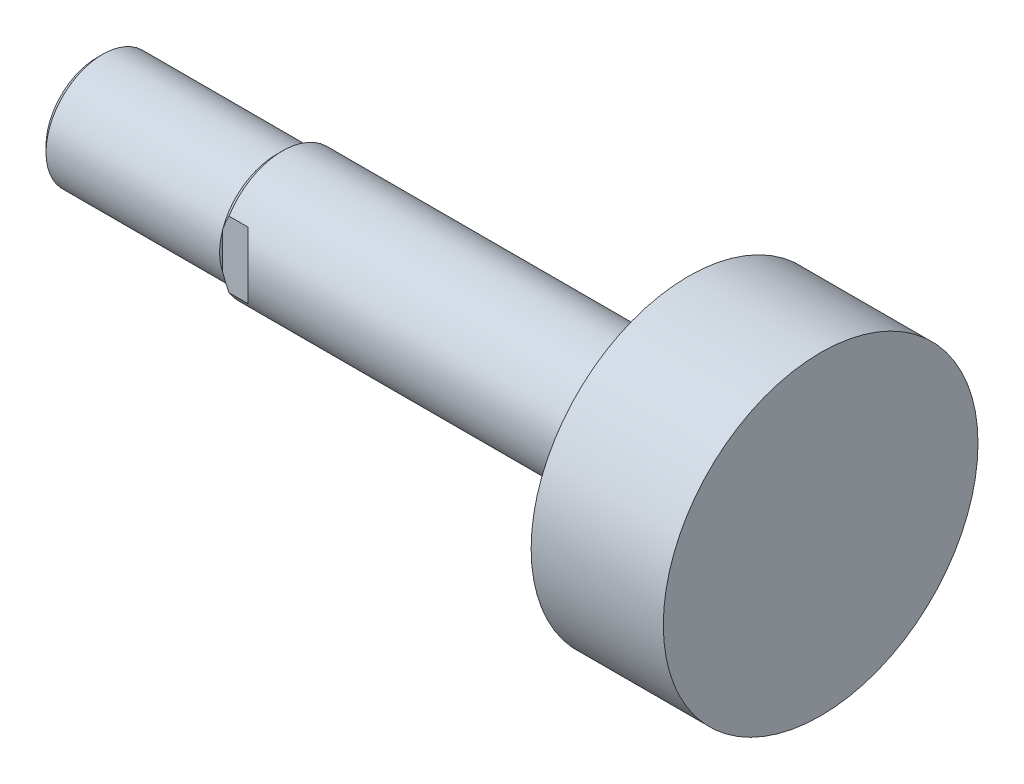
ISO-10303-21;
HEADER;
FILE_DESCRIPTION(('STEP AP214'),'2;1');
FILE_NAME('part.step','',(''),(''),'','','');
FILE_SCHEMA(('AUTOMOTIVE_DESIGN { 1 0 10303 214 1 1 1 1 }'));
ENDSEC;
DATA;
#1=APPLICATION_CONTEXT('core data for automotive mechanical design processes');
#2=APPLICATION_PROTOCOL_DEFINITION('international standard','automotive_design',2000,#1);
#3=PRODUCT_CONTEXT('',#1,'mechanical');
#4=PRODUCT('Part','Part','',(#3));
#5=PRODUCT_RELATED_PRODUCT_CATEGORY('part','',(#4));
#6=PRODUCT_DEFINITION_FORMATION('','',#4);
#7=PRODUCT_DEFINITION_CONTEXT('part definition',#1,'design');
#8=PRODUCT_DEFINITION('design','',#6,#7);
#9=PRODUCT_DEFINITION_SHAPE('','',#8);
#10=(LENGTH_UNIT() NAMED_UNIT(*) SI_UNIT(.MILLI.,.METRE.));
#11=(NAMED_UNIT(*) PLANE_ANGLE_UNIT() SI_UNIT($,.RADIAN.));
#12=(NAMED_UNIT(*) SI_UNIT($,.STERADIAN.) SOLID_ANGLE_UNIT());
#13=UNCERTAINTY_MEASURE_WITH_UNIT(LENGTH_MEASURE(1.E-05),#10,'distance_accuracy_value','');
#14=(GEOMETRIC_REPRESENTATION_CONTEXT(3) GLOBAL_UNCERTAINTY_ASSIGNED_CONTEXT((#13)) GLOBAL_UNIT_ASSIGNED_CONTEXT((#10,
#11,#12)) REPRESENTATION_CONTEXT('',''));
#15=CARTESIAN_POINT('',(0.,0.,0.));
#16=DIRECTION('',(0.,0.,1.));
#17=DIRECTION('',(1.,0.,0.));
#18=AXIS2_PLACEMENT_3D('',#15,#16,#17);
#19=CARTESIAN_POINT('',(-4.,0.,0.));
#20=DIRECTION('',(1.,0.,0.));
#21=DIRECTION('',(0.,0.,-1.));
#22=AXIS2_PLACEMENT_3D('',#19,#20,#21);
#23=CONICAL_SURFACE('',#22,10.,0.785398163397448);
#24=CARTESIAN_POINT('',(-4.,0.,0.));
#25=DIRECTION('',(-1.,0.,0.));
#26=DIRECTION('',(0.,0.,1.));
#27=AXIS2_PLACEMENT_3D('',#24,#25,#26);
#28=CIRCLE('',#27,10.);
#29=CARTESIAN_POINT('',(-4.,5.26782687642637,8.5));
#30=VERTEX_POINT('',#29);
#31=CARTESIAN_POINT('',(-4.,5.26782687642637,-8.5));
#32=VERTEX_POINT('',#31);
#33=EDGE_CURVE('E102',#30,#32,#28,.T.);
#34=ORIENTED_EDGE('',*,*,#33,.T.);
#35=CARTESIAN_POINT('',(8.01519063670047,20.308092445384,-8.5));
#36=CARTESIAN_POINT('',(7.7361785847848,20.0056182532984,-8.5));
#37=CARTESIAN_POINT('',(7.45765995569865,19.7026880348964,-8.5));
#38=CARTESIAN_POINT('',(6.90176517488605,19.0957771073713,-8.5));
#39=CARTESIAN_POINT('',(6.62438903182765,18.7917963903104,-8.5));
#40=CARTESIAN_POINT('',(6.07087745418935,18.1825827710552,-8.5));
#41=CARTESIAN_POINT('',(5.79474230969481,17.8773496050566,-8.5));
#42=CARTESIAN_POINT('',(5.24398019039066,17.2655281148894,-8.5));
#43=CARTESIAN_POINT('',(4.96935321256268,16.9589397934352,-8.5));
#44=CARTESIAN_POINT('',(4.14478580015422,16.0331775775104,-8.5));
#45=CARTESIAN_POINT('',(3.5974766026319,15.4116476657744,-8.5));
#46=CARTESIAN_POINT('',(2.78380816430986,14.4730892085653,-8.5));
#47=CARTESIAN_POINT('',(2.5138152184636,14.159209089997,-8.5));
#48=CARTESIAN_POINT('',(1.97673021972096,13.52897508431,-8.5));
#49=CARTESIAN_POINT('',(1.70963815361385,13.2126212084681,-8.5));
#50=CARTESIAN_POINT('',(1.22962921286077,12.6377055641449,-8.5));
#51=CARTESIAN_POINT('',(1.01610941182202,12.3796473964932,-8.5));
#52=CARTESIAN_POINT('',(0.591750155601345,11.8613374878778,-8.5));
#53=CARTESIAN_POINT('',(0.380910678472077,11.6010857649047,-8.5));
#54=CARTESIAN_POINT('',(-0.0376584099303825,11.0779783508777,-8.5));
#55=CARTESIAN_POINT('',(-0.245387192834079,10.8151219961295,-8.5));
#56=CARTESIAN_POINT('',(-0.657066865708468,10.2864655282631,-8.5));
#57=CARTESIAN_POINT('',(-0.86101778345529,10.0206654368112,-8.5));
#58=CARTESIAN_POINT('',(-1.26415199097759,9.48591907241199,-8.5));
#59=CARTESIAN_POINT('',(-1.46334021328241,9.21697652576224,-8.5));
#60=CARTESIAN_POINT('',(-1.85619918997769,8.67506458946009,-8.5));
#61=CARTESIAN_POINT('',(-2.04986972807254,8.40209504258244,-8.5));
#62=CARTESIAN_POINT('',(-2.43032661979991,7.85155574203699,-8.5));
#63=CARTESIAN_POINT('',(-2.61711587067953,7.57398799740128,-8.5));
#64=CARTESIAN_POINT('',(-2.98220778874802,7.01334556695261,-8.5));
#65=CARTESIAN_POINT('',(-3.1605114105711,6.73027150567247,-8.5));
#66=CARTESIAN_POINT('',(-3.50458625851543,6.16073556198903,-8.5));
#67=CARTESIAN_POINT('',(-3.6704720212901,5.87434326842555,-8.5));
#68=CARTESIAN_POINT('',(-3.98901950101887,5.29419670486178,-8.5));
#69=CARTESIAN_POINT('',(-4.14167975814724,5.00044162676269,-8.5));
#70=CARTESIAN_POINT('',(-4.42996817465509,4.404921954279,-8.5));
#71=CARTESIAN_POINT('',(-4.56561073144721,4.10316439565823,-8.5));
#72=CARTESIAN_POINT('',(-4.81535306459375,3.49081408919009,-8.5));
#73=CARTESIAN_POINT('',(-4.92945908792876,3.18022393353545,-8.5));
#74=CARTESIAN_POINT('',(-5.10882864210821,2.61868293217366,-8.5));
#75=CARTESIAN_POINT('',(-5.17931789927641,2.3694108183374,-8.5));
#76=CARTESIAN_POINT('',(-5.30097712319222,1.86616027833244,-8.5));
#77=CARTESIAN_POINT('',(-5.35214960650299,1.61218246974123,-8.5));
#78=CARTESIAN_POINT('',(-5.43261746197934,1.10153191863139,-8.5));
#79=CARTESIAN_POINT('',(-5.46197934937759,0.844869810696362,-8.5));
#80=CARTESIAN_POINT('',(-5.49747629899316,0.329928811847649,-8.5));
#81=CARTESIAN_POINT('',(-5.5036124053603,0.0716499941384825,-8.5));
#82=CARTESIAN_POINT('',(-5.49229216801082,-0.444827574385673,-8.5));
#83=CARTESIAN_POINT('',(-5.47479509778217,-0.703025418080532,-8.5));
#84=CARTESIAN_POINT('',(-5.41713803657892,-1.21685788244489,-8.5));
#85=CARTESIAN_POINT('',(-5.37697616728612,-1.47249228888529,-8.5));
#86=CARTESIAN_POINT('',(-5.27590994809915,-1.98038492098679,-8.5));
#87=CARTESIAN_POINT('',(-5.21494230073249,-2.23263037326976,-8.5));
#88=CARTESIAN_POINT('',(-5.07495959430864,-2.73200202992384,-8.5));
#89=CARTESIAN_POINT('',(-4.99594408568338,-2.9791281066052,-8.5));
#90=CARTESIAN_POINT('',(-4.80921484945979,-3.50573917313349,-8.5));
#91=CARTESIAN_POINT('',(-4.69895230505636,-3.78431367662233,-8.5));
#92=CARTESIAN_POINT('',(-4.46189975933577,-4.33439896644819,-8.5));
#93=CARTESIAN_POINT('',(-4.335102381747,-4.60590653495482,-8.5));
#94=CARTESIAN_POINT('',(-4.0680489135709,-5.14275897977233,-8.5));
#95=CARTESIAN_POINT('',(-3.92776978391186,-5.40809230836008,-8.5));
#96=CARTESIAN_POINT('',(-3.63659017674462,-5.93277996074427,-8.5));
#97=CARTESIAN_POINT('',(-3.48569114282922,-6.19213509083541,-8.5));
#98=CARTESIAN_POINT('',(-3.17343042128541,-6.70876016534357,-8.5));
#99=CARTESIAN_POINT('',(-3.01196381516393,-6.96596639752857,-8.5));
#100=CARTESIAN_POINT('',(-2.68190708992094,-7.4757577100788,-8.5));
#101=CARTESIAN_POINT('',(-2.5133167965904,-7.72834267721476,-8.5));
#102=CARTESIAN_POINT('',(-2.17048919845415,-8.22925435257358,-8.5));
#103=CARTESIAN_POINT('',(-1.99625793113806,-8.47758520513955,-8.5));
#104=CARTESIAN_POINT('',(-1.64298541847278,-8.97080912154977,-8.5));
#105=CARTESIAN_POINT('',(-1.46394397240567,-9.21570204128561,-8.5));
#106=CARTESIAN_POINT('',(-1.10059809810329,-9.7041954587909,-8.5));
#107=CARTESIAN_POINT('',(-0.916265740598766,-9.94777514580776,-8.5));
#108=CARTESIAN_POINT('',(-0.544180663254515,-10.4323108471719,-8.5));
#109=CARTESIAN_POINT('',(-0.356427872872254,-10.6732668072437,-8.5));
#110=CARTESIAN_POINT('',(0.211180026363605,-11.3927534627755,-8.5));
#111=CARTESIAN_POINT('',(0.595361447438551,-11.8678720045883,-8.5));
#112=CARTESIAN_POINT('',(1.37246441028024,-12.8114834634273,-8.5));
#113=CARTESIAN_POINT('',(1.7653924464481,-13.2799710039858,-8.5));
#114=CARTESIAN_POINT('',(2.55767079172638,-14.211489799482,-8.5));
#115=CARTESIAN_POINT('',(2.9570212214443,-14.6745209516694,-8.5));
#116=CARTESIAN_POINT('',(3.74033075167738,-15.572898310212,-8.5));
#117=CARTESIAN_POINT('',(4.12404469096696,-16.008458712548,-8.5));
#118=CARTESIAN_POINT('',(4.8950592601401,-16.8764018975631,-8.5));
#119=CARTESIAN_POINT('',(5.2823599431561,-17.308784632999,-8.5));
#120=CARTESIAN_POINT('',(6.05923302335683,-18.1702364496551,-8.5));
#121=CARTESIAN_POINT('',(6.44880074336688,-18.5993097536896,-8.5));
#122=CARTESIAN_POINT('',(7.23032368065,-19.4552486172027,-8.5));
#123=CARTESIAN_POINT('',(7.62227881030234,-19.8821142566546,-8.5));
#124=CARTESIAN_POINT('',(8.01519063670047,-20.308092445384,-8.5));
#125=B_SPLINE_CURVE_WITH_KNOTS('',3,(#35,#36,#37,#38,#39,#40,#41,#42,#43,#44,#45,#46,#47,#48,
#49,#50,#51,#52,#53,#54,#55,#56,#57,#58,#59,#60,#61,#62,#63,#64,#65,#66,#67,#68,#69,#70,#71,#72,
#73,#74,#75,#76,#77,#78,#79,#80,#81,#82,#83,#84,#85,#86,#87,#88,#89,#90,#91,#92,#93,#94,#95,#96,
#97,#98,#99,#100,#101,#102,#103,#104,#105,#106,#107,#108,#109,#110,#111,#112,#113,#114,#115,
#116,#117,#118,#119,#120,#121,#122,#123,#124),.UNSPECIFIED.,.F.,.F.,(4,2,2,2,2,2,2,2,2,2,2,2,2,
2,2,2,2,2,2,2,2,2,2,2,2,2,2,2,2,2,2,2,2,2,2,2,2,2,2,2,2,2,2,2,4),(0.,1.23452259257757,
2.46905453429761,3.70386142712238,4.93866584775406,7.42305221398594,8.66511507344633,
9.90717227411993,10.9119770974516,11.9167736878189,12.9218332577486,13.9268854352086,
14.930847189359,15.9348482452458,16.9384216368664,17.9418818581811,18.9345065453003,
19.9272406586858,20.9191291471583,21.9107294804817,22.6872174420708,23.4636042089177,
24.2376134165246,25.0115878269729,25.7868977128977,26.5622718611428,27.3400262785907,
28.1178000718358,29.0159336722359,29.9144693140022,30.8145687393038,31.7145460470604,
32.6254677943538,33.5364118310505,34.4464111820271,35.3564485643851,36.2728106057291,
37.1891915674402,39.0220694747481,40.8563569637266,42.6906789394955,44.4320757148611,
46.1734983279044,47.9121094387404,49.650657120432),.UNSPECIFIED.);
#126=CARTESIAN_POINT('',(-5.,2.95803989154981,-8.5));
#127=VERTEX_POINT('',#126);
#128=EDGE_CURVE('E229',#32,#127,#125,.T.);
#129=ORIENTED_EDGE('',*,*,#128,.T.);
#130=CARTESIAN_POINT('',(-5.,0.,0.));
#131=DIRECTION('',(-1.,0.,0.));
#132=DIRECTION('',(0.,0.,1.));
#133=AXIS2_PLACEMENT_3D('',#130,#131,#132);
#134=CIRCLE('',#133,9.);
#135=CARTESIAN_POINT('',(-5.,2.95803989154981,8.5));
#136=VERTEX_POINT('',#135);
#137=EDGE_CURVE('E104',#136,#127,#134,.T.);
#138=ORIENTED_EDGE('',*,*,#137,.F.);
#139=CARTESIAN_POINT('',(8.01519063670047,-20.308092445384,8.5));
#140=CARTESIAN_POINT('',(7.7361785847848,-20.0056182532984,8.5));
#141=CARTESIAN_POINT('',(7.45765995569865,-19.7026880348963,8.5));
#142=CARTESIAN_POINT('',(6.90176517488605,-19.0957771073713,8.5));
#143=CARTESIAN_POINT('',(6.62438903182765,-18.7917963903104,8.5));
#144=CARTESIAN_POINT('',(6.07087745418935,-18.1825827710552,8.5));
#145=CARTESIAN_POINT('',(5.79474230969481,-17.8773496050566,8.5));
#146=CARTESIAN_POINT('',(5.24398019039066,-17.2655281148894,8.5));
#147=CARTESIAN_POINT('',(4.96935321256268,-16.9589397934352,8.5));
#148=CARTESIAN_POINT('',(4.14478580015422,-16.0331775775104,8.5));
#149=CARTESIAN_POINT('',(3.5974766026319,-15.4116476657744,8.5));
#150=CARTESIAN_POINT('',(2.78380816430985,-14.4730892085653,8.5));
#151=CARTESIAN_POINT('',(2.5138152184636,-14.159209089997,8.5));
#152=CARTESIAN_POINT('',(1.97673021972096,-13.52897508431,8.5));
#153=CARTESIAN_POINT('',(1.70963815361385,-13.2126212084681,8.5));
#154=CARTESIAN_POINT('',(1.22962921286077,-12.6377055641449,8.5));
#155=CARTESIAN_POINT('',(1.01610941182202,-12.3796473964932,8.5));
#156=CARTESIAN_POINT('',(0.591750155601346,-11.8613374878778,8.5));
#157=CARTESIAN_POINT('',(0.380910678472079,-11.6010857649047,8.5));
#158=CARTESIAN_POINT('',(-0.0376584099303806,-11.0779783508777,8.5));
#159=CARTESIAN_POINT('',(-0.245387192834078,-10.8151219961295,8.5));
#160=CARTESIAN_POINT('',(-0.657066865708467,-10.2864655282631,8.5));
#161=CARTESIAN_POINT('',(-0.861017783455289,-10.0206654368112,8.5));
#162=CARTESIAN_POINT('',(-1.26415199097759,-9.48591907241199,8.5));
#163=CARTESIAN_POINT('',(-1.4633402132824,-9.21697652576224,8.5));
#164=CARTESIAN_POINT('',(-1.85619918997768,-8.6750645894601,8.5));
#165=CARTESIAN_POINT('',(-2.04986972807254,-8.40209504258245,8.5));
#166=CARTESIAN_POINT('',(-2.43032661979991,-7.85155574203699,8.5));
#167=CARTESIAN_POINT('',(-2.61711587067953,-7.57398799740128,8.5));
#168=CARTESIAN_POINT('',(-2.98220778874802,-7.01334556695262,8.5));
#169=CARTESIAN_POINT('',(-3.1605114105711,-6.73027150567248,8.5));
#170=CARTESIAN_POINT('',(-3.50458625851543,-6.16073556198904,8.5));
#171=CARTESIAN_POINT('',(-3.6704720212901,-5.87434326842556,8.5));
#172=CARTESIAN_POINT('',(-3.98901950101887,-5.29419670486178,8.5));
#173=CARTESIAN_POINT('',(-4.14167975814723,-5.00044162676269,8.5));
#174=CARTESIAN_POINT('',(-4.42996817465509,-4.40492195427901,8.5));
#175=CARTESIAN_POINT('',(-4.56561073144721,-4.10316439565824,8.5));
#176=CARTESIAN_POINT('',(-4.81535306459374,-3.4908140891901,8.5));
#177=CARTESIAN_POINT('',(-4.92945908792876,-3.18022393353545,8.5));
#178=CARTESIAN_POINT('',(-5.10882864210821,-2.61868293217367,8.5));
#179=CARTESIAN_POINT('',(-5.17931789927641,-2.36941081833741,8.5));
#180=CARTESIAN_POINT('',(-5.30097712319222,-1.86616027833245,8.5));
#181=CARTESIAN_POINT('',(-5.35214960650299,-1.61218246974123,8.5));
#182=CARTESIAN_POINT('',(-5.43261746197933,-1.1015319186314,8.5));
#183=CARTESIAN_POINT('',(-5.46197934937759,-0.844869810696367,8.5));
#184=CARTESIAN_POINT('',(-5.49747629899316,-0.329928811847654,8.5));
#185=CARTESIAN_POINT('',(-5.5036124053603,-0.0716499941384873,8.5));
#186=CARTESIAN_POINT('',(-5.49229216801082,0.444827574385668,8.5));
#187=CARTESIAN_POINT('',(-5.47479509778217,0.703025418080528,8.5));
#188=CARTESIAN_POINT('',(-5.41713803657892,1.21685788244489,8.5));
#189=CARTESIAN_POINT('',(-5.37697616728612,1.47249228888529,8.5));
#190=CARTESIAN_POINT('',(-5.27590994809915,1.98038492098679,8.5));
#191=CARTESIAN_POINT('',(-5.21494230073249,2.23263037326977,8.5));
#192=CARTESIAN_POINT('',(-5.07495959430864,2.73200202992385,8.5));
#193=CARTESIAN_POINT('',(-4.99594408568338,2.9791281066052,8.5));
#194=CARTESIAN_POINT('',(-4.80921484945979,3.50573917313348,8.5));
#195=CARTESIAN_POINT('',(-4.69895230505636,3.78431367662232,8.5));
#196=CARTESIAN_POINT('',(-4.46189975933577,4.33439896644819,8.5));
#197=CARTESIAN_POINT('',(-4.335102381747,4.60590653495482,8.5));
#198=CARTESIAN_POINT('',(-4.0680489135709,5.14275897977233,8.5));
#199=CARTESIAN_POINT('',(-3.92776978391186,5.40809230836008,8.5));
#200=CARTESIAN_POINT('',(-3.63659017674462,5.93277996074427,8.5));
#201=CARTESIAN_POINT('',(-3.48569114282922,6.19213509083541,8.5));
#202=CARTESIAN_POINT('',(-3.17343042128541,6.70876016534356,8.5));
#203=CARTESIAN_POINT('',(-3.01196381516393,6.96596639752857,8.5));
#204=CARTESIAN_POINT('',(-2.68190708992094,7.4757577100788,8.5));
#205=CARTESIAN_POINT('',(-2.5133167965904,7.72834267721476,8.5));
#206=CARTESIAN_POINT('',(-2.17048919845416,8.22925435257357,8.5));
#207=CARTESIAN_POINT('',(-1.99625793113807,8.47758520513955,8.5));
#208=CARTESIAN_POINT('',(-1.64298541847278,8.97080912154977,8.5));
#209=CARTESIAN_POINT('',(-1.46394397240567,9.2157020412856,8.5));
#210=CARTESIAN_POINT('',(-1.10059809810329,9.7041954587909,8.5));
#211=CARTESIAN_POINT('',(-0.916265740598765,9.94777514580776,8.5));
#212=CARTESIAN_POINT('',(-0.544180663254515,10.4323108471719,8.5));
#213=CARTESIAN_POINT('',(-0.356427872872254,10.6732668072437,8.5));
#214=CARTESIAN_POINT('',(0.211180026363606,11.3927534627755,8.5));
#215=CARTESIAN_POINT('',(0.595361447438553,11.8678720045883,8.5));
#216=CARTESIAN_POINT('',(1.37246441028024,12.8114834634273,8.5));
#217=CARTESIAN_POINT('',(1.7653924464481,13.2799710039858,8.5));
#218=CARTESIAN_POINT('',(2.55767079172638,14.211489799482,8.5));
#219=CARTESIAN_POINT('',(2.9570212214443,14.6745209516694,8.5));
#220=CARTESIAN_POINT('',(3.74033075167738,15.572898310212,8.5));
#221=CARTESIAN_POINT('',(4.12404469096697,16.008458712548,8.5));
#222=CARTESIAN_POINT('',(4.89505926014011,16.8764018975631,8.5));
#223=CARTESIAN_POINT('',(5.28235994315611,17.308784632999,8.5));
#224=CARTESIAN_POINT('',(6.05923302335684,18.1702364496551,8.5));
#225=CARTESIAN_POINT('',(6.44880074336689,18.5993097536896,8.5));
#226=CARTESIAN_POINT('',(7.23032368065001,19.4552486172027,8.5));
#227=CARTESIAN_POINT('',(7.62227881030234,19.8821142566546,8.5));
#228=CARTESIAN_POINT('',(8.01519063670047,20.308092445384,8.5));
#229=B_SPLINE_CURVE_WITH_KNOTS('',3,(#139,#140,#141,#142,#143,#144,#145,#146,#147,#148,#149,
#150,#151,#152,#153,#154,#155,#156,#157,#158,#159,#160,#161,#162,#163,#164,#165,#166,#167,#168,
#169,#170,#171,#172,#173,#174,#175,#176,#177,#178,#179,#180,#181,#182,#183,#184,#185,#186,#187,
#188,#189,#190,#191,#192,#193,#194,#195,#196,#197,#198,#199,#200,#201,#202,#203,#204,#205,#206,
#207,#208,#209,#210,#211,#212,#213,#214,#215,#216,#217,#218,#219,#220,#221,#222,#223,#224,#225,
#226,#227,#228),.UNSPECIFIED.,.F.,.F.,(4,2,2,2,2,2,2,2,2,2,2,2,2,2,2,2,2,2,2,2,2,2,2,2,2,2,2,2,
2,2,2,2,2,2,2,2,2,2,2,2,2,2,2,2,4),(0.,1.23452259257757,2.46905453429761,3.70386142712238,
4.93866584775405,7.42305221398594,8.66511507344633,9.90717227411992,10.9119770974516,
11.9167736878189,12.9218332577486,13.9268854352086,14.930847189359,15.9348482452458,
16.9384216368664,17.9418818581811,18.9345065453003,19.9272406586858,20.9191291471583,
21.9107294804817,22.6872174420708,23.4636042089177,24.2376134165246,25.0115878269729,
25.7868977128977,26.5622718611428,27.3400262785907,28.1178000718358,29.0159336722359,
29.9144693140022,30.8145687393038,31.7145460470603,32.6254677943538,33.5364118310504,
34.4464111820271,35.3564485643851,36.2728106057291,37.1891915674402,39.0220694747481,
40.8563569637266,42.6906789394955,44.4320757148612,46.1734983279044,47.9121094387404,
49.650657120432),.UNSPECIFIED.);
#230=EDGE_CURVE('E109',#136,#30,#229,.T.);
#231=ORIENTED_EDGE('',*,*,#230,.T.);
#232=EDGE_LOOP('',(#34,#129,#138,#231));
#233=FACE_BOUND('',#232,.T.);
#234=ADVANCED_FACE('F39',(#233),#23,.T.);
#235=CARTESIAN_POINT('',(81.5,0.,0.));
#236=DIRECTION('',(-1.,0.,0.));
#237=DIRECTION('',(0.,0.,1.));
#238=AXIS2_PLACEMENT_3D('',#235,#236,#237);
#239=CYLINDRICAL_SURFACE('',#238,10.);
#240=CARTESIAN_POINT('',(60.5,0.,0.));
#241=DIRECTION('',(-1.,0.,0.));
#242=DIRECTION('',(0.,0.,1.));
#243=AXIS2_PLACEMENT_3D('',#240,#241,#242);
#244=CIRCLE('',#243,10.);
#245=CARTESIAN_POINT('',(60.5,0.,10.));
#246=VERTEX_POINT('',#245);
#247=EDGE_CURVE('E139',#246,#246,#244,.T.);
#248=ORIENTED_EDGE('',*,*,#247,.T.);
#249=EDGE_LOOP('',(#248));
#250=FACE_BOUND('',#249,.T.);
#251=CARTESIAN_POINT('',(-9.49999999999999,0.,0.));
#252=DIRECTION('',(0.707106781186547,0.,0.707106781186547));
#253=DIRECTION('',(-0.707106781186548,0.,0.707106781186548));
#254=AXIS2_PLACEMENT_3D('',#251,#252,#253);
#255=ELLIPSE('',#254,14.142135623731,10.);
#256=CARTESIAN_POINT('',(-1.,-5.26782687642637,-8.5));
#257=VERTEX_POINT('',#256);
#258=CARTESIAN_POINT('',(-1.,5.26782687642637,-8.5));
#259=VERTEX_POINT('',#258);
#260=EDGE_CURVE('E11',#257,#259,#255,.T.);
#261=ORIENTED_EDGE('',*,*,#260,.T.);
#262=DIRECTION('',(-1.,0.,0.));
#263=VECTOR('',#262,1.);
#264=CARTESIAN_POINT('',(81.5,5.26782687642637,-8.5));
#265=LINE('',#264,#263);
#266=EDGE_CURVE('E215',#259,#32,#265,.T.);
#267=ORIENTED_EDGE('',*,*,#266,.T.);
#268=ORIENTED_EDGE('',*,*,#33,.F.);
#269=DIRECTION('',(-1.,0.,0.));
#270=VECTOR('',#269,1.);
#271=CARTESIAN_POINT('',(81.5,5.26782687642637,8.5));
#272=LINE('',#271,#270);
#273=CARTESIAN_POINT('',(-1.,5.26782687642637,8.5));
#274=VERTEX_POINT('',#273);
#275=EDGE_CURVE('E54',#30,#274,#272,.F.);
#276=ORIENTED_EDGE('',*,*,#275,.T.);
#277=CARTESIAN_POINT('',(-9.49999999999999,0.,0.));
#278=DIRECTION('',(0.707106781186547,0.,-0.707106781186547));
#279=DIRECTION('',(-0.707106781186548,0.,-0.707106781186548));
#280=AXIS2_PLACEMENT_3D('',#277,#278,#279);
#281=ELLIPSE('',#280,14.142135623731,10.);
#282=CARTESIAN_POINT('',(-1.,-5.26782687642638,8.5));
#283=VERTEX_POINT('',#282);
#284=EDGE_CURVE('E47',#274,#283,#281,.T.);
#285=ORIENTED_EDGE('',*,*,#284,.T.);
#286=DIRECTION('',(-1.,0.,0.));
#287=VECTOR('',#286,1.);
#288=CARTESIAN_POINT('',(81.5,-5.26782687642637,8.5));
#289=LINE('',#288,#287);
#290=CARTESIAN_POINT('',(-4.,-5.26782687642637,8.5));
#291=VERTEX_POINT('',#290);
#292=EDGE_CURVE('E222',#283,#291,#289,.T.);
#293=ORIENTED_EDGE('',*,*,#292,.T.);
#294=CARTESIAN_POINT('',(-4.,-5.26782687642637,-8.5));
#295=VERTEX_POINT('',#294);
#296=EDGE_CURVE('E119',#295,#291,#28,.T.);
#297=ORIENTED_EDGE('',*,*,#296,.F.);
#298=DIRECTION('',(-1.,0.,0.));
#299=VECTOR('',#298,1.);
#300=CARTESIAN_POINT('',(81.5,-5.26782687642637,-8.5));
#301=LINE('',#300,#299);
#302=EDGE_CURVE('E216',#295,#257,#301,.F.);
#303=ORIENTED_EDGE('',*,*,#302,.T.);
#304=EDGE_LOOP('',(#261,#267,#268,#276,#285,#293,#297,#303));
#305=FACE_BOUND('',#304,.T.);
#306=ADVANCED_FACE('F41',(#250,#305),#239,.T.);
#307=CARTESIAN_POINT('',(60.5,10.,0.));
#308=DIRECTION('',(1.,0.,0.));
#309=DIRECTION('',(0.,0.,-1.));
#310=AXIS2_PLACEMENT_3D('',#307,#308,#309);
#311=PLANE('',#310);
#312=ORIENTED_EDGE('',*,*,#247,.F.);
#313=EDGE_LOOP('',(#312));
#314=FACE_BOUND('',#313,.T.);
#315=CARTESIAN_POINT('',(60.5,0.,0.));
#316=DIRECTION('',(-1.,0.,0.));
#317=DIRECTION('',(0.,0.,1.));
#318=AXIS2_PLACEMENT_3D('',#315,#316,#317);
#319=CIRCLE('',#318,25.);
#320=CARTESIAN_POINT('',(60.5,0.,25.));
#321=VERTEX_POINT('',#320);
#322=EDGE_CURVE('E136',#321,#321,#319,.T.);
#323=ORIENTED_EDGE('',*,*,#322,.T.);
#324=EDGE_LOOP('',(#323));
#325=FACE_BOUND('',#324,.T.);
#326=ADVANCED_FACE('F175',(#314,#325),#311,.F.);
#327=CARTESIAN_POINT('',(81.5,0.,0.));
#328=DIRECTION('',(-1.,0.,0.));
#329=DIRECTION('',(0.,0.,1.));
#330=AXIS2_PLACEMENT_3D('',#327,#328,#329);
#331=CYLINDRICAL_SURFACE('',#330,25.);
#332=ORIENTED_EDGE('',*,*,#322,.F.);
#333=EDGE_LOOP('',(#332));
#334=FACE_BOUND('',#333,.T.);
#335=CARTESIAN_POINT('',(81.5,0.,0.));
#336=DIRECTION('',(-1.,0.,0.));
#337=DIRECTION('',(0.,0.,1.));
#338=AXIS2_PLACEMENT_3D('',#335,#336,#337);
#339=CIRCLE('',#338,25.);
#340=CARTESIAN_POINT('',(81.5,0.,25.));
#341=VERTEX_POINT('',#340);
#342=EDGE_CURVE('E133',#341,#341,#339,.T.);
#343=ORIENTED_EDGE('',*,*,#342,.T.);
#344=EDGE_LOOP('',(#343));
#345=FACE_BOUND('',#344,.T.);
#346=ADVANCED_FACE('F198',(#334,#345),#331,.T.);
#347=CARTESIAN_POINT('',(81.5,25.,0.));
#348=DIRECTION('',(-1.,0.,0.));
#349=DIRECTION('',(0.,0.,1.));
#350=AXIS2_PLACEMENT_3D('',#347,#348,#349);
#351=PLANE('',#350);
#352=ORIENTED_EDGE('',*,*,#342,.F.);
#353=EDGE_LOOP('',(#352));
#354=FACE_BOUND('',#353,.T.);
#355=ADVANCED_FACE('F194',(#354),#351,.F.);
#356=CARTESIAN_POINT('',(-33.5,0.,0.));
#357=DIRECTION('',(1.,0.,0.));
#358=DIRECTION('',(0.,0.,-1.));
#359=AXIS2_PLACEMENT_3D('',#356,#357,#358);
#360=PLANE('',#359);
#361=CARTESIAN_POINT('',(-33.5,0.,0.));
#362=DIRECTION('',(-1.,0.,0.));
#363=DIRECTION('',(0.,0.,1.));
#364=AXIS2_PLACEMENT_3D('',#361,#362,#363);
#365=CIRCLE('',#364,8.08);
#366=CARTESIAN_POINT('',(-33.5,0.,8.08));
#367=VERTEX_POINT('',#366);
#368=EDGE_CURVE('E130',#367,#367,#365,.T.);
#369=ORIENTED_EDGE('',*,*,#368,.T.);
#370=EDGE_LOOP('',(#369));
#371=FACE_BOUND('',#370,.T.);
#372=ADVANCED_FACE('F187',(#371),#360,.F.);
#373=CARTESIAN_POINT('',(-32.58,0.,0.));
#374=DIRECTION('',(1.,0.,0.));
#375=DIRECTION('',(0.,0.,-1.));
#376=AXIS2_PLACEMENT_3D('',#373,#374,#375);
#377=CONICAL_SURFACE('',#376,9.,0.785398163397446);
#378=ORIENTED_EDGE('',*,*,#368,.F.);
#379=EDGE_LOOP('',(#378));
#380=FACE_BOUND('',#379,.T.);
#381=CARTESIAN_POINT('',(-32.58,0.,0.));
#382=DIRECTION('',(-1.,0.,0.));
#383=DIRECTION('',(0.,0.,1.));
#384=AXIS2_PLACEMENT_3D('',#381,#382,#383);
#385=CIRCLE('',#384,9.);
#386=CARTESIAN_POINT('',(-32.58,0.,9.));
#387=VERTEX_POINT('',#386);
#388=EDGE_CURVE('E126',#387,#387,#385,.T.);
#389=ORIENTED_EDGE('',*,*,#388,.T.);
#390=EDGE_LOOP('',(#389));
#391=FACE_BOUND('',#390,.T.);
#392=ADVANCED_FACE('F182',(#380,#391),#377,.T.);
#393=CARTESIAN_POINT('',(0.,0.,0.));
#394=DIRECTION('',(-1.,0.,0.));
#395=DIRECTION('',(0.,0.,1.));
#396=AXIS2_PLACEMENT_3D('',#393,#394,#395);
#397=CYLINDRICAL_SURFACE('',#396,9.);
#398=ORIENTED_EDGE('',*,*,#388,.F.);
#399=EDGE_LOOP('',(#398));
#400=FACE_BOUND('',#399,.T.);
#401=ORIENTED_EDGE('',*,*,#137,.T.);
#402=CARTESIAN_POINT('',(-5.,-2.95803989154981,-8.5));
#403=VERTEX_POINT('',#402);
#404=EDGE_CURVE('E123',#127,#403,#134,.T.);
#405=ORIENTED_EDGE('',*,*,#404,.T.);
#406=CARTESIAN_POINT('',(-5.,-2.95803989154981,8.5));
#407=VERTEX_POINT('',#406);
#408=EDGE_CURVE('E101',#403,#407,#134,.T.);
#409=ORIENTED_EDGE('',*,*,#408,.T.);
#410=EDGE_CURVE('E93',#407,#136,#134,.T.);
#411=ORIENTED_EDGE('',*,*,#410,.T.);
#412=EDGE_LOOP('',(#401,#405,#409,#411));
#413=FACE_BOUND('',#412,.T.);
#414=ADVANCED_FACE('F122',(#400,#413),#397,.T.);
#415=ORIENTED_EDGE('',*,*,#408,.F.);
#416=EDGE_CURVE('E120',#403,#295,#125,.T.);
#417=ORIENTED_EDGE('',*,*,#416,.T.);
#418=ORIENTED_EDGE('',*,*,#296,.T.);
#419=EDGE_CURVE('E107',#291,#407,#229,.T.);
#420=ORIENTED_EDGE('',*,*,#419,.T.);
#421=EDGE_LOOP('',(#415,#417,#418,#420));
#422=FACE_BOUND('',#421,.T.);
#423=ADVANCED_FACE('F115',(#422),#23,.T.);
#424=CARTESIAN_POINT('',(-1.,-17.,8.5));
#425=DIRECTION('',(0.,0.,-1.));
#426=DIRECTION('',(-1.,0.,0.));
#427=AXIS2_PLACEMENT_3D('',#424,#425,#426);
#428=PLANE('',#427);
#429=DIRECTION('',(0.,1.,0.));
#430=VECTOR('',#429,1.);
#431=CARTESIAN_POINT('',(-1.,-17.,8.5));
#432=LINE('',#431,#430);
#433=EDGE_CURVE('E110',#283,#274,#432,.T.);
#434=ORIENTED_EDGE('',*,*,#433,.T.);
#435=ORIENTED_EDGE('',*,*,#275,.F.);
#436=ORIENTED_EDGE('',*,*,#230,.F.);
#437=DIRECTION('',(0.,1.,0.));
#438=VECTOR('',#437,1.);
#439=CARTESIAN_POINT('',(-5.,-17.,8.5));
#440=LINE('',#439,#438);
#441=EDGE_CURVE('E96',#407,#136,#440,.T.);
#442=ORIENTED_EDGE('',*,*,#441,.F.);
#443=ORIENTED_EDGE('',*,*,#419,.F.);
#444=ORIENTED_EDGE('',*,*,#292,.F.);
#445=EDGE_LOOP('',(#434,#435,#436,#442,#443,#444));
#446=FACE_BOUND('',#445,.T.);
#447=ADVANCED_FACE('F106',(#446),#428,.F.);
#448=CARTESIAN_POINT('',(-5.,-17.,8.5));
#449=DIRECTION('',(-1.,0.,0.));
#450=DIRECTION('',(0.,0.,1.));
#451=AXIS2_PLACEMENT_3D('',#448,#449,#450);
#452=PLANE('',#451);
#453=ORIENTED_EDGE('',*,*,#441,.T.);
#454=ORIENTED_EDGE('',*,*,#410,.F.);
#455=EDGE_LOOP('',(#453,#454));
#456=FACE_BOUND('',#455,.T.);
#457=ADVANCED_FACE('F95',(#456),#452,.F.);
#458=CARTESIAN_POINT('',(19.,-17.,28.5));
#459=DIRECTION('',(0.707106781186547,0.,-0.707106781186547));
#460=DIRECTION('',(-0.707106781186548,0.,-0.707106781186548));
#461=AXIS2_PLACEMENT_3D('',#458,#459,#460);
#462=PLANE('',#461);
#463=ORIENTED_EDGE('',*,*,#433,.F.);
#464=ORIENTED_EDGE('',*,*,#284,.F.);
#465=EDGE_LOOP('',(#463,#464));
#466=FACE_BOUND('',#465,.T.);
#467=ADVANCED_FACE('F158',(#466),#462,.F.);
#468=CARTESIAN_POINT('',(-1.,-17.,-8.5));
#469=DIRECTION('',(0.707106781186547,0.,0.707106781186547));
#470=DIRECTION('',(0.707106781186548,0.,-0.707106781186548));
#471=AXIS2_PLACEMENT_3D('',#468,#469,#470);
#472=PLANE('',#471);
#473=DIRECTION('',(0.,1.,0.));
#474=VECTOR('',#473,1.);
#475=CARTESIAN_POINT('',(-1.,-17.,-8.5));
#476=LINE('',#475,#474);
#477=EDGE_CURVE('E219',#257,#259,#476,.T.);
#478=ORIENTED_EDGE('',*,*,#477,.T.);
#479=ORIENTED_EDGE('',*,*,#260,.F.);
#480=EDGE_LOOP('',(#478,#479));
#481=FACE_BOUND('',#480,.T.);
#482=ADVANCED_FACE('F160',(#481),#472,.F.);
#483=CARTESIAN_POINT('',(-5.,-17.,-8.5));
#484=DIRECTION('',(0.,0.,1.));
#485=DIRECTION('',(1.,0.,0.));
#486=AXIS2_PLACEMENT_3D('',#483,#484,#485);
#487=PLANE('',#486);
#488=ORIENTED_EDGE('',*,*,#477,.F.);
#489=ORIENTED_EDGE('',*,*,#302,.F.);
#490=ORIENTED_EDGE('',*,*,#416,.F.);
#491=DIRECTION('',(0.,1.,0.));
#492=VECTOR('',#491,1.);
#493=CARTESIAN_POINT('',(-5.,-17.,-8.5));
#494=LINE('',#493,#492);
#495=EDGE_CURVE('E61',#403,#127,#494,.T.);
#496=ORIENTED_EDGE('',*,*,#495,.T.);
#497=ORIENTED_EDGE('',*,*,#128,.F.);
#498=ORIENTED_EDGE('',*,*,#266,.F.);
#499=EDGE_LOOP('',(#488,#489,#490,#496,#497,#498));
#500=FACE_BOUND('',#499,.T.);
#501=ADVANCED_FACE('F166',(#500),#487,.F.);
#502=CARTESIAN_POINT('',(-5.,-17.,-18.5));
#503=DIRECTION('',(-1.,0.,0.));
#504=DIRECTION('',(0.,0.,1.));
#505=AXIS2_PLACEMENT_3D('',#502,#503,#504);
#506=PLANE('',#505);
#507=ORIENTED_EDGE('',*,*,#495,.F.);
#508=ORIENTED_EDGE('',*,*,#404,.F.);
#509=EDGE_LOOP('',(#507,#508));
#510=FACE_BOUND('',#509,.T.);
#511=ADVANCED_FACE('F232',(#510),#506,.F.);
#512=CLOSED_SHELL('',(#234,#306,#326,#346,#355,#372,#392,#414,#423,#447,#457,#467,#482,#501,#511));
#513=MANIFOLD_SOLID_BREP('B2',#512);
#514=ADVANCED_BREP_SHAPE_REPRESENTATION('',(#18,#513),#14);
#515=SHAPE_DEFINITION_REPRESENTATION(#9,#514);
ENDSEC;
END-ISO-10303-21;
